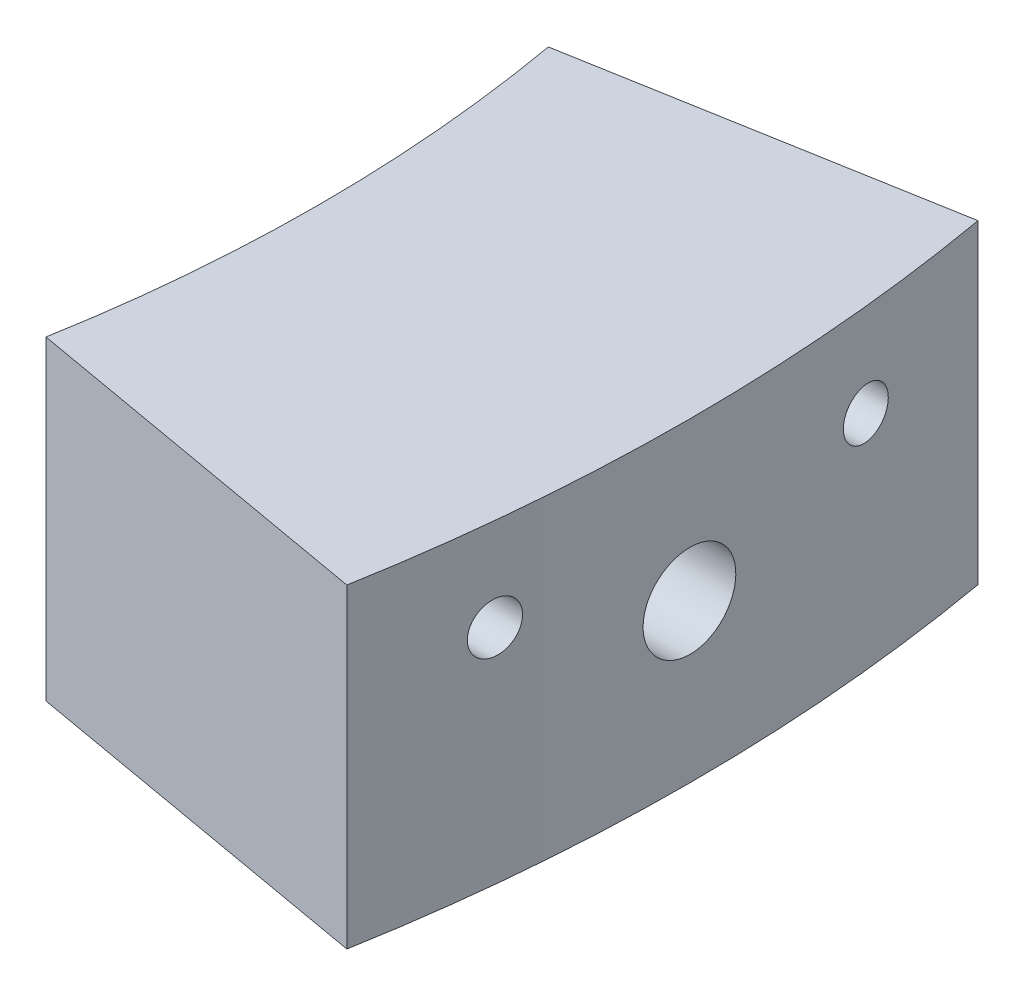
ISO-10303-21;
HEADER;
FILE_DESCRIPTION(('STEP AP214'),'2;1');
FILE_NAME('part.step','',(''),(''),'','','');
FILE_SCHEMA(('AUTOMOTIVE_DESIGN { 1 0 10303 214 1 1 1 1 }'));
ENDSEC;
DATA;
#1=APPLICATION_CONTEXT('core data for automotive mechanical design processes');
#2=APPLICATION_PROTOCOL_DEFINITION('international standard','automotive_design',2000,#1);
#3=PRODUCT_CONTEXT('',#1,'mechanical');
#4=PRODUCT('Part','Part','',(#3));
#5=PRODUCT_RELATED_PRODUCT_CATEGORY('part','',(#4));
#6=PRODUCT_DEFINITION_FORMATION('','',#4);
#7=PRODUCT_DEFINITION_CONTEXT('part definition',#1,'design');
#8=PRODUCT_DEFINITION('design','',#6,#7);
#9=PRODUCT_DEFINITION_SHAPE('','',#8);
#10=(LENGTH_UNIT() NAMED_UNIT(*) SI_UNIT(.MILLI.,.METRE.));
#11=(NAMED_UNIT(*) PLANE_ANGLE_UNIT() SI_UNIT($,.RADIAN.));
#12=(NAMED_UNIT(*) SI_UNIT($,.STERADIAN.) SOLID_ANGLE_UNIT());
#13=UNCERTAINTY_MEASURE_WITH_UNIT(LENGTH_MEASURE(1.E-05),#10,'distance_accuracy_value','');
#14=(GEOMETRIC_REPRESENTATION_CONTEXT(3) GLOBAL_UNCERTAINTY_ASSIGNED_CONTEXT((#13)) GLOBAL_UNIT_ASSIGNED_CONTEXT((#10,
#11,#12)) REPRESENTATION_CONTEXT('',''));
#15=CARTESIAN_POINT('',(0.,0.,0.));
#16=DIRECTION('',(0.,0.,1.));
#17=DIRECTION('',(1.,0.,0.));
#18=AXIS2_PLACEMENT_3D('',#15,#16,#17);
#19=CARTESIAN_POINT('',(0.,-55.,0.));
#20=DIRECTION('',(0.,-1.,0.));
#21=DIRECTION('',(0.,0.,-1.));
#22=AXIS2_PLACEMENT_3D('',#19,#20,#21);
#23=CYLINDRICAL_SURFACE('',#22,98.);
#24=CARTESIAN_POINT('',(97.617506114426,12.,-8.65));
#25=CARTESIAN_POINT('',(97.6175058938993,12.0756007993206,-8.65000338407852));
#26=CARTESIAN_POINT('',(97.6169421117702,12.1512564351228,-8.65637224766953));
#27=CARTESIAN_POINT('',(97.6146939909887,12.3004805079778,-8.6816860254161));
#28=CARTESIAN_POINT('',(97.6130083052985,12.3740463249972,-8.70064605737195));
#29=CARTESIAN_POINT('',(97.6085438644557,12.5169036890432,-8.75058795159761));
#30=CARTESIAN_POINT('',(97.6057657101686,12.5861975614752,-8.78156320528482));
#31=CARTESIAN_POINT('',(97.5991641563164,12.7185719489254,-8.85463127721825));
#32=CARTESIAN_POINT('',(97.5953410107909,12.7816539689944,-8.89672139333398));
#33=CARTESIAN_POINT('',(97.5867108456557,12.8999563939583,-8.99088976889658));
#34=CARTESIAN_POINT('',(97.5819021993175,12.9551635412288,-9.04298453357049));
#35=CARTESIAN_POINT('',(97.571398069416,13.0560532320898,-9.15562514482282));
#36=CARTESIAN_POINT('',(97.5657025366273,13.1017352466699,-9.21617146047505));
#37=CARTESIAN_POINT('',(97.5535211950221,13.1824622700676,-9.34423075414013));
#38=CARTESIAN_POINT('',(97.5470325050066,13.2174667806461,-9.41176898616757));
#39=CARTESIAN_POINT('',(97.533429720916,13.2756455349094,-9.55170268231237));
#40=CARTESIAN_POINT('',(97.5263156127135,13.2988195112761,-9.62409825614252));
#41=CARTESIAN_POINT('',(97.5116044276869,13.3327841113824,-9.77202884155926));
#42=CARTESIAN_POINT('',(97.5040053693319,13.3435199734052,-9.8475762305508));
#43=CARTESIAN_POINT('',(97.4885547871177,13.3521387874624,-9.99937526415877));
#44=CARTESIAN_POINT('',(97.4807032581113,13.3500214772838,-10.0756269231111));
#45=CARTESIAN_POINT('',(97.4649455743222,13.3329724903921,-10.2269345253978));
#46=CARTESIAN_POINT('',(97.4570393248677,13.317998928458,-10.3019857427445));
#47=CARTESIAN_POINT('',(97.4414392979856,13.275600442672,-10.4485089621508));
#48=CARTESIAN_POINT('',(97.4337455225573,13.2481754016927,-10.5199809305343));
#49=CARTESIAN_POINT('',(97.4188176592374,13.1816254382963,-10.6573329097117));
#50=CARTESIAN_POINT('',(97.4115837077598,13.1424970633614,-10.7232112629995));
#51=CARTESIAN_POINT('',(97.3978259035663,13.0536329011521,-10.8474615797574));
#52=CARTESIAN_POINT('',(97.3913020404219,13.00389726969,-10.9058336534687));
#53=CARTESIAN_POINT('',(97.3792204690145,12.8954056254773,-11.0131891665927));
#54=CARTESIAN_POINT('',(97.3736594560466,12.8366818246748,-11.0622047812184));
#55=CARTESIAN_POINT('',(97.3636834646136,12.7117434448966,-11.1496675443441));
#56=CARTESIAN_POINT('',(97.3592684481071,12.6455291146744,-11.188115043656));
#57=CARTESIAN_POINT('',(97.3517778847092,12.5079162999805,-11.2531067580318));
#58=CARTESIAN_POINT('',(97.3486944180242,12.4365514990423,-11.2797213814947));
#59=CARTESIAN_POINT('',(97.3439495736175,12.2903226894122,-11.3205966594754));
#60=CARTESIAN_POINT('',(97.3422881466805,12.2154588019146,-11.3348577415365));
#61=CARTESIAN_POINT('',(97.3404586449799,12.0647924635099,-11.350558314679));
#62=CARTESIAN_POINT('',(97.3402825161529,11.9889973094097,-11.3520669562692));
#63=CARTESIAN_POINT('',(97.3414094439378,11.8382323626186,-11.3423996725422));
#64=CARTESIAN_POINT('',(97.342712477651,11.7632625571687,-11.3312239435907));
#65=CARTESIAN_POINT('',(97.3467426215184,11.6164040982219,-11.2965482225053));
#66=CARTESIAN_POINT('',(97.3494673390388,11.5445104869015,-11.2730689364551));
#67=CARTESIAN_POINT('',(97.3562333189262,11.4056943117121,-11.2144860951274));
#68=CARTESIAN_POINT('',(97.360274596349,11.3387718047018,-11.1793824069169));
#69=CARTESIAN_POINT('',(97.3695343466853,11.2115692537785,-11.0984430925857));
#70=CARTESIAN_POINT('',(97.3747563768328,11.151310118731,-11.0525750206201));
#71=CARTESIAN_POINT('',(97.3861776394716,11.0393390634186,-10.9514832664502));
#72=CARTESIAN_POINT('',(97.3923769022613,10.9876274082642,-10.8962592941687));
#73=CARTESIAN_POINT('',(97.4055719951196,10.8938898621378,-10.7776675631688));
#74=CARTESIAN_POINT('',(97.41257235092,10.8519235123728,-10.7142532457144));
#75=CARTESIAN_POINT('',(97.4270998095378,10.7792272701204,-10.5813367298362));
#76=CARTESIAN_POINT('',(97.4346269287605,10.7484977277735,-10.511834341791));
#77=CARTESIAN_POINT('',(97.4500060785924,10.6989796327809,-10.3682953919038));
#78=CARTESIAN_POINT('',(97.4578596789248,10.6802582136608,-10.2942358324461));
#79=CARTESIAN_POINT('',(97.4736089499044,10.6555483344656,-10.1440257914772));
#80=CARTESIAN_POINT('',(97.4815046213789,10.6495601257032,-10.0678752687271));
#81=CARTESIAN_POINT('',(97.4971272847418,10.650491387794,-9.91544527744967));
#82=CARTESIAN_POINT('',(97.5048538142863,10.657442623514,-9.83916595208761));
#83=CARTESIAN_POINT('',(97.5199064361653,10.6841333049673,-9.68883674286622));
#84=CARTESIAN_POINT('',(97.5272325287914,10.7038727413894,-9.61478685738365));
#85=CARTESIAN_POINT('',(97.5412885728223,10.7555672859957,-9.47112614740109));
#86=CARTESIAN_POINT('',(97.548019261618,10.7875070160195,-9.4015098628223));
#87=CARTESIAN_POINT('',(97.5607355720813,10.862716795528,-9.26862102172229));
#88=CARTESIAN_POINT('',(97.5667212363069,10.9059861973873,-9.20534810288802));
#89=CARTESIAN_POINT('',(97.5777953632539,11.0024501668243,-9.08720888408853));
#90=CARTESIAN_POINT('',(97.5828872310794,11.0556054035995,-9.03231078804239));
#91=CARTESIAN_POINT('',(97.5921011766639,11.1704689378447,-8.93220701905186));
#92=CARTESIAN_POINT('',(97.5962230349727,11.2321791657457,-8.88700353957502));
#93=CARTESIAN_POINT('',(97.603404334642,11.3621211873785,-8.80778311484221));
#94=CARTESIAN_POINT('',(97.6064678486473,11.4303266633606,-8.7737233146981));
#95=CARTESIAN_POINT('',(97.6114988775306,11.5714705552505,-8.71757358768449));
#96=CARTESIAN_POINT('',(97.6134677350447,11.6444030500926,-8.6954689982246));
#97=CARTESIAN_POINT('',(97.6157502674053,11.7648405875568,-8.66979757609393));
#98=CARTESIAN_POINT('',(97.6164081827595,11.8115540427385,-8.66238296265514));
#99=CARTESIAN_POINT('',(97.617286174771,11.9055045233873,-8.65248312169049));
#100=CARTESIAN_POINT('',(97.6175062522784,11.9527415478378,-8.64999788459495));
#101=CARTESIAN_POINT('',(97.617506114426,12.,-8.65));
#102=B_SPLINE_CURVE_WITH_KNOTS('',3,(#24,#25,#26,#27,#28,#29,#30,#31,#32,#33,#34,#35,#36,#37,
#38,#39,#40,#41,#42,#43,#44,#45,#46,#47,#48,#49,#50,#51,#52,#53,#54,#55,#56,#57,#58,#59,#60,#61,
#62,#63,#64,#65,#66,#67,#68,#69,#70,#71,#72,#73,#74,#75,#76,#77,#78,#79,#80,#81,#82,#83,#84,#85,
#86,#87,#88,#89,#90,#91,#92,#93,#94,#95,#96,#97,#98,#99,#100,#101),.UNSPECIFIED.,.T.,.F.,(4,2,2,
2,2,2,2,2,2,2,2,2,2,2,2,2,2,2,2,2,2,2,2,2,2,2,2,2,2,2,2,2,2,2,2,2,2,2,4),(0.,0.226629599913219,
0.453531799664552,0.680309375784831,0.907031870758643,1.13413166648978,1.3612440716171,
1.58920746698041,1.81717601308778,2.0461444751452,2.27511760832359,2.50483957098709,
2.73456369462449,2.96435565450426,3.19414423915325,3.42312779477472,3.65210374830057,
3.87969838473457,4.10728514403756,4.33363700997512,4.55998537182448,4.78595402177813,
5.01192525592659,5.23858656144373,5.4652548958188,5.69327367119327,5.9212995510557,
6.15058938689487,6.37988374813849,6.60974174347262,6.83959957144371,7.06916862045153,
7.29872454972031,7.52738600430264,7.75609914051431,7.98392209091633,8.21146498823325,
8.35313260279017,8.49479994231946),.UNSPECIFIED.);
#103=CARTESIAN_POINT('',(97.617506114426,12.,-8.65));
#104=VERTEX_POINT('',#103);
#105=EDGE_CURVE('E120',#104,#104,#102,.T.);
#106=ORIENTED_EDGE('',*,*,#105,.T.);
#107=EDGE_LOOP('',(#106));
#108=FACE_BOUND('',#107,.T.);
#109=CARTESIAN_POINT('',(0.,0.,0.));
#110=DIRECTION('',(0.,-1.,0.));
#111=DIRECTION('',(0.,0.,-1.));
#112=AXIS2_PLACEMENT_3D('',#109,#110,#111);
#113=CIRCLE('',#112,98.);
#114=CARTESIAN_POINT('',(96.5111597951964,0.,-17.0175214113592));
#115=VERTEX_POINT('',#114);
#116=CARTESIAN_POINT('',(96.5111597951964,0.,17.0175214113592));
#117=VERTEX_POINT('',#116);
#118=EDGE_CURVE('E47',#115,#117,#113,.T.);
#119=ORIENTED_EDGE('',*,*,#118,.F.);
#120=DIRECTION('',(0.,1.,0.));
#121=VECTOR('',#120,1.);
#122=CARTESIAN_POINT('',(96.5111597951964,17.,-17.0175214113592));
#123=LINE('',#122,#121);
#124=CARTESIAN_POINT('',(96.5111597951964,17.,-17.0175214113592));
#125=VERTEX_POINT('',#124);
#126=EDGE_CURVE('E87',#115,#125,#123,.T.);
#127=ORIENTED_EDGE('',*,*,#126,.T.);
#128=CARTESIAN_POINT('',(0.,17.,0.));
#129=DIRECTION('',(0.,-1.,0.));
#130=DIRECTION('',(0.,0.,-1.));
#131=AXIS2_PLACEMENT_3D('',#128,#129,#130);
#132=CIRCLE('',#131,98.);
#133=CARTESIAN_POINT('',(96.5111597951964,17.,17.0175214113592));
#134=VERTEX_POINT('',#133);
#135=EDGE_CURVE('E11',#125,#134,#132,.T.);
#136=ORIENTED_EDGE('',*,*,#135,.T.);
#137=DIRECTION('',(0.,1.,0.));
#138=VECTOR('',#137,1.);
#139=CARTESIAN_POINT('',(96.5111597951964,17.,17.0175214113592));
#140=LINE('',#139,#138);
#141=EDGE_CURVE('E99',#117,#134,#140,.T.);
#142=ORIENTED_EDGE('',*,*,#141,.F.);
#143=EDGE_LOOP('',(#119,#127,#136,#142));
#144=FACE_BOUND('',#143,.T.);
#145=CARTESIAN_POINT('',(97.9681070553065,8.5,2.5));
#146=CARTESIAN_POINT('',(97.968107485919,8.64040158260716,2.49999378126655));
#147=CARTESIAN_POINT('',(97.9684121189138,8.78090438813225,2.48813274061241));
#148=CARTESIAN_POINT('',(97.969598041761,9.05803879705092,2.44098223178922));
#149=CARTESIAN_POINT('',(97.9704800218772,9.19466556207155,2.4056647188224));
#150=CARTESIAN_POINT('',(97.9727206630696,9.45999291119347,2.3126088372722));
#151=CARTESIAN_POINT('',(97.9740790924453,9.58869731229674,2.25488136535125));
#152=CARTESIAN_POINT('',(97.9771192675297,9.83455230261818,2.11865968320301));
#153=CARTESIAN_POINT('',(97.9788009338786,9.95170571712585,2.04017056851032));
#154=CARTESIAN_POINT('',(97.9822988269544,10.171212707976,1.86461886388693));
#155=CARTESIAN_POINT('',(97.984115094958,10.2735617157904,1.76755056193709));
#156=CARTESIAN_POINT('',(97.9876771078848,10.4605163734568,1.55760519734132));
#157=CARTESIAN_POINT('',(97.9894228500082,10.5451213194385,1.44472750786558));
#158=CARTESIAN_POINT('',(97.9926471673846,10.6941909251843,1.20635372303399));
#159=CARTESIAN_POINT('',(97.994125711171,10.7586532134957,1.08085614419978));
#160=CARTESIAN_POINT('',(97.9966486747316,10.8655920635036,0.820815651392319));
#161=CARTESIAN_POINT('',(97.9976930960059,10.908068701165,0.686272768674207));
#162=CARTESIAN_POINT('',(97.999229876335,10.9698216851936,0.41199194423426));
#163=CARTESIAN_POINT('',(97.999722356071,10.9891031032261,0.272255145060123));
#164=CARTESIAN_POINT('',(98.0001001407963,11.0039339288226,-0.0084726653707868));
#165=CARTESIAN_POINT('',(97.9999854478403,10.9994834166901,-0.14946367238199));
#166=CARTESIAN_POINT('',(97.9991619207296,10.9669810409501,-0.428663296402774));
#167=CARTESIAN_POINT('',(97.9984532247125,10.9389346646373,-0.566872552666637));
#168=CARTESIAN_POINT('',(97.9965217300213,10.8600451753218,-0.836620409790409));
#169=CARTESIAN_POINT('',(97.9952989303794,10.8092020194081,-0.968158998093375));
#170=CARTESIAN_POINT('',(97.9924768188702,10.6861559344986,-1.22084919433756));
#171=CARTESIAN_POINT('',(97.990877462657,10.6139504894839,-1.34199957660205));
#172=CARTESIAN_POINT('',(97.9874825014726,10.4502313740402,-1.57046085749863));
#173=CARTESIAN_POINT('',(97.9856868961991,10.3587176738643,-1.67777173480868));
#174=CARTESIAN_POINT('',(97.9821012141159,10.1589487168563,-1.87553984246272));
#175=CARTESIAN_POINT('',(97.9803111390278,10.050688695938,-1.96599226062271));
#176=CARTESIAN_POINT('',(97.9769388477739,9.82051703856403,-2.12743877338321));
#177=CARTESIAN_POINT('',(97.97535663164,9.69860540001149,-2.19843286499489));
#178=CARTESIAN_POINT('',(97.9725784941908,9.44458849614742,-2.31894689803893));
#179=CARTESIAN_POINT('',(97.9713825756067,9.31248315877174,-2.36846668764277));
#180=CARTESIAN_POINT('',(97.9695119931908,9.04183009614148,-2.44462333931151));
#181=CARTESIAN_POINT('',(97.9688373283254,8.90328238366224,-2.47126024675155));
#182=CARTESIAN_POINT('',(97.9680855085796,8.62371932373841,-2.50088910759738));
#183=CARTESIAN_POINT('',(97.968008185302,8.48270468298385,-2.50388772489719));
#184=CARTESIAN_POINT('',(97.9684593277916,8.20217394484546,-2.48617224676661));
#185=CARTESIAN_POINT('',(97.9689877930589,8.06265784622525,-2.46545817090224));
#186=CARTESIAN_POINT('',(97.9705907835769,7.78910315987337,-2.40091082591723));
#187=CARTESIAN_POINT('',(97.971665237386,7.65506385799192,-2.3570805814742));
#188=CARTESIAN_POINT('',(97.9742390172399,7.39624577728101,-2.24754816169502));
#189=CARTESIAN_POINT('',(97.975738343888,7.27146701160168,-2.18184595530099));
#190=CARTESIAN_POINT('',(97.978993256679,7.03468134795426,-2.03041749090833));
#191=CARTESIAN_POINT('',(97.9807489002402,6.92267732173128,-1.9446867436709));
#192=CARTESIAN_POINT('',(97.9843183228818,6.7146493747087,-1.75564138414763));
#193=CARTESIAN_POINT('',(97.986132102076,6.61862548518069,-1.65232673745259));
#194=CARTESIAN_POINT('',(97.9896138117065,6.44526139722469,-1.43101779835808));
#195=CARTESIAN_POINT('',(97.9912817085364,6.36792549668027,-1.31302013857839));
#196=CARTESIAN_POINT('',(97.9942831516635,6.23416209345677,-1.06571196806448));
#197=CARTESIAN_POINT('',(97.9956166986034,6.1777345505873,-0.936401479076576));
#198=CARTESIAN_POINT('',(97.9977989503728,6.0873971567584,-0.670154542831078));
#199=CARTESIAN_POINT('',(97.9986477152983,6.05348451465369,-0.533219043119038));
#200=CARTESIAN_POINT('',(97.999764960206,6.00913041665887,-0.255595690200751));
#201=CARTESIAN_POINT('',(98.0000334402659,5.99868895762704,-0.114907837496774));
#202=CARTESIAN_POINT('',(97.9999598526234,6.00157396799025,0.16618345178214));
#203=CARTESIAN_POINT('',(97.9996179591967,6.01489365303175,0.306586958085752));
#204=CARTESIAN_POINT('',(97.9983624962978,6.06490892902668,0.583164337772367));
#205=CARTESIAN_POINT('',(97.9974489256882,6.10160456649251,0.719338202738857));
#206=CARTESIAN_POINT('',(97.9951530311703,6.19732940343915,0.98359402754766));
#207=CARTESIAN_POINT('',(97.9937706990715,6.25635899316206,1.11167584595166));
#208=CARTESIAN_POINT('',(97.9906930812302,6.39507305368881,1.3561079283874));
#209=CARTESIAN_POINT('',(97.9889978070745,6.47475675981197,1.47245862652083));
#210=CARTESIAN_POINT('',(97.9854849037729,6.65253439797914,1.69015520138881));
#211=CARTESIAN_POINT('',(97.9836672527697,6.7506316243948,1.79149838730911));
#212=CARTESIAN_POINT('',(97.9801142485092,6.96247618604376,1.97630465077829));
#213=CARTESIAN_POINT('',(97.9783789157628,7.07622739447693,2.05976329011864));
#214=CARTESIAN_POINT('',(97.9751857225554,7.31618857858428,2.2064417635846));
#215=CARTESIAN_POINT('',(97.9737280294355,7.44240599883694,2.26964940743262));
#216=CARTESIAN_POINT('',(97.971257657333,7.70356709527613,2.37390357618586));
#217=CARTESIAN_POINT('',(97.9702444471708,7.83850013329794,2.41497656661719));
#218=CARTESIAN_POINT('',(97.9690485345763,8.06190636349387,2.46289357520565));
#219=CARTESIAN_POINT('',(97.9686970101231,8.14892902850971,2.47679101533046));
#220=CARTESIAN_POINT('',(97.9682261354992,8.32395452799873,2.49534617656206));
#221=CARTESIAN_POINT('',(97.9681067852793,8.41195736226427,2.50000389962625));
#222=CARTESIAN_POINT('',(97.9681070553065,8.5,2.5));
#223=B_SPLINE_CURVE_WITH_KNOTS('',3,(#145,#146,#147,#148,#149,#150,#151,#152,#153,#154,#155,
#156,#157,#158,#159,#160,#161,#162,#163,#164,#165,#166,#167,#168,#169,#170,#171,#172,#173,#174,
#175,#176,#177,#178,#179,#180,#181,#182,#183,#184,#185,#186,#187,#188,#189,#190,#191,#192,#193,
#194,#195,#196,#197,#198,#199,#200,#201,#202,#203,#204,#205,#206,#207,#208,#209,#210,#211,#212,
#213,#214,#215,#216,#217,#218,#219,#220,#221,#222),.UNSPECIFIED.,.T.,.F.,(4,2,2,2,2,2,2,2,2,2,2,
2,2,2,2,2,2,2,2,2,2,2,2,2,2,2,2,2,2,2,2,2,2,2,2,2,2,2,4),(0.,0.420883383923988,
0.842270888378501,1.26345375267084,1.68453334171725,2.10574259678617,2.52696855720151,
2.94824409108494,3.36951816936732,3.79070011876548,4.2118806429795,4.63296324736447,
5.0540466443708,5.47517965571612,5.89631331587841,6.31756700357265,6.73882075597217,
7.16007748668935,7.5813333820822,8.00247051655574,8.4236073035374,8.84468899976766,
9.2657712939305,9.68694806106084,10.1081256523838,10.5294000145863,10.950673567004,
11.3718948848873,11.7931161463884,12.214217158773,12.635319009048,13.0564282175937,
13.4775218375717,13.898690867541,14.3199642936075,14.7414908347943,15.16251224888,
15.426438698011,15.6903650912304),.UNSPECIFIED.);
#224=CARTESIAN_POINT('',(97.9681070553065,8.5,2.5));
#225=VERTEX_POINT('',#224);
#226=EDGE_CURVE('E100',#225,#225,#223,.T.);
#227=ORIENTED_EDGE('',*,*,#226,.T.);
#228=EDGE_LOOP('',(#227));
#229=FACE_BOUND('',#228,.T.);
#230=CARTESIAN_POINT('',(97.3405234216459,12.,11.35));
#231=CARTESIAN_POINT('',(97.3405238985553,12.0754638648849,11.3499965911601));
#232=CARTESIAN_POINT('',(97.3412644310656,12.1509825849718,11.3436504908883));
#233=CARTESIAN_POINT('',(97.3442000569033,12.2999326510784,11.318430550952));
#234=CARTESIAN_POINT('',(97.3463969011006,12.3733613734081,11.2995416314729));
#235=CARTESIAN_POINT('',(97.3521579447706,12.5159444430285,11.2497985126167));
#236=CARTESIAN_POINT('',(97.3557212804354,12.5851014586168,11.2189518720088));
#237=CARTESIAN_POINT('',(97.3640772443317,12.7172241326816,11.1462009885888));
#238=CARTESIAN_POINT('',(97.3688695865325,12.7801912270489,11.104299318586));
#239=CARTESIAN_POINT('',(97.3795225064962,12.8984029990248,11.0104870733307));
#240=CARTESIAN_POINT('',(97.3853865456494,12.9536215979908,10.9585440338961));
#241=CARTESIAN_POINT('',(97.3979604175589,13.0545680971438,10.8462202577641));
#242=CARTESIAN_POINT('',(97.404670308935,13.1002953389741,10.7858389362411));
#243=CARTESIAN_POINT('',(97.4187471109318,13.1812562593298,10.6579486238244));
#244=CARTESIAN_POINT('',(97.4261178259064,13.2164233365429,10.5903978873537));
#245=CARTESIAN_POINT('',(97.4412352132167,13.2749141203946,10.4503891589164));
#246=CARTESIAN_POINT('',(97.4489818960009,13.298237497679,10.3779310305466));
#247=CARTESIAN_POINT('',(97.4646449739879,13.3324807297961,10.2297874380116));
#248=CARTESIAN_POINT('',(97.4725620045163,13.3433406176094,10.1540881735803));
#249=CARTESIAN_POINT('',(97.4882927608992,13.3521478382795,10.0019310052802));
#250=CARTESIAN_POINT('',(97.4961064857563,13.3500950465778,9.92547309410032));
#251=CARTESIAN_POINT('',(97.5114214030391,13.3331128555162,9.77386868965295));
#252=CARTESIAN_POINT('',(97.5189221876199,13.3181671710183,9.69872397762216));
#253=CARTESIAN_POINT('',(97.5334040293795,13.2757820096316,9.5519912646198));
#254=CARTESIAN_POINT('',(97.5403850903122,13.2483426229958,9.48040323795927));
#255=CARTESIAN_POINT('',(97.5536425230083,13.1818039976323,9.34299681653559));
#256=CARTESIAN_POINT('',(97.5599204438193,13.1427311121581,9.27716581191186));
#257=CARTESIAN_POINT('',(97.5716485478158,13.0539939769671,9.15299378765771));
#258=CARTESIAN_POINT('',(97.5770987486043,13.0043299525455,9.09465260874561));
#259=CARTESIAN_POINT('',(97.5870373370423,12.8960410521386,8.98738228594786));
#260=CARTESIAN_POINT('',(97.5915296486052,12.8374544876003,8.93841483116842));
#261=CARTESIAN_POINT('',(97.5994952814251,12.7128281253679,8.85101424258972));
#262=CARTESIAN_POINT('',(97.6029686261404,12.6467884993041,8.8125808662797));
#263=CARTESIAN_POINT('',(97.608822099932,12.5094292082689,8.74750915322322));
#264=CARTESIAN_POINT('',(97.6112067506231,12.4381328371313,8.72082204822512));
#265=CARTESIAN_POINT('',(97.614864348484,12.2920465205618,8.67978607950772));
#266=CARTESIAN_POINT('',(97.6161373153129,12.2172566369344,8.66543699760068));
#267=CARTESIAN_POINT('',(97.6175491083862,12.0665325472068,8.64951854395059));
#268=CARTESIAN_POINT('',(97.6176911236164,11.9906021640122,8.6479132381533));
#269=CARTESIAN_POINT('',(97.616847180644,11.8395506531571,8.6574342917708));
#270=CARTESIAN_POINT('',(97.6158612313783,11.7644295190898,8.66856055031351));
#271=CARTESIAN_POINT('',(97.6127782519995,11.6171880228797,8.70320750807748));
#272=CARTESIAN_POINT('',(97.6106820821019,11.5450653840546,8.72671861126001));
#273=CARTESIAN_POINT('',(97.6054135979262,11.4057986995408,8.78544822936005));
#274=CARTESIAN_POINT('',(97.6022412801686,11.3386546699494,8.82066678212898));
#275=CARTESIAN_POINT('',(97.5948700862851,11.2111437109513,8.90185319042564));
#276=CARTESIAN_POINT('',(97.590669761198,11.1507865242885,8.94783621429939));
#277=CARTESIAN_POINT('',(97.5813226321452,11.0386488769401,9.04920202029316));
#278=CARTESIAN_POINT('',(97.5761758139972,10.9868685447927,9.1045849432609));
#279=CARTESIAN_POINT('',(97.5650197248982,10.8931659734527,9.22336648738432));
#280=CARTESIAN_POINT('',(97.5590076513764,10.8512769840891,9.28679107288269));
#281=CARTESIAN_POINT('',(97.5462641244818,10.7787350947477,9.4197031275333));
#282=CARTESIAN_POINT('',(97.5395326553952,10.7480824402707,9.48919072911437));
#283=CARTESIAN_POINT('',(97.5254771119805,10.6987417910935,9.63257604363354));
#284=CARTESIAN_POINT('',(97.5181505876657,10.6801064119248,9.70649162232801));
#285=CARTESIAN_POINT('',(97.5031165262437,10.6555163659937,9.85636535934353));
#286=CARTESIAN_POINT('',(97.4954089792296,10.6495620291234,9.93232357075077));
#287=CARTESIAN_POINT('',(97.4797929006922,10.6504899695436,10.0844357065722));
#288=CARTESIAN_POINT('',(97.4718837123873,10.6574215049629,10.1605892661475));
#289=CARTESIAN_POINT('',(97.4561248235508,10.684019302326,10.3106463637201));
#290=CARTESIAN_POINT('',(97.4482751239547,10.7036857641288,10.3845498663866));
#291=CARTESIAN_POINT('',(97.4328692613726,10.7552431308162,10.5281152695401));
#292=CARTESIAN_POINT('',(97.4253135283555,10.7871512514263,10.5977710357264));
#293=CARTESIAN_POINT('',(97.4107581159809,10.8623018577461,10.7307353865598));
#294=CARTESIAN_POINT('',(97.4037584112153,10.9055438251598,10.7940442612666));
#295=CARTESIAN_POINT('',(97.3905754597257,11.002035715155,10.9123486164912));
#296=CARTESIAN_POINT('',(97.3843902597688,11.0552609249728,10.9673640329001));
#297=CARTESIAN_POINT('',(97.3730404320074,11.17031142294,11.0676805629712));
#298=CARTESIAN_POINT('',(97.3678760304698,11.2321386126131,11.1129795231045));
#299=CARTESIAN_POINT('',(97.3587889096424,11.3622874095192,11.1923104612624));
#300=CARTESIAN_POINT('',(97.3548600725867,11.4305747689894,11.2263979912579));
#301=CARTESIAN_POINT('',(97.3483652497533,11.571911297857,11.2825790870108));
#302=CARTESIAN_POINT('',(97.3457975623512,11.6449543929842,11.3046876289202));
#303=CARTESIAN_POINT('',(97.3428192516716,11.7653996280743,11.3302969933968));
#304=CARTESIAN_POINT('',(97.3419597447279,11.8120017707833,11.3376760419847));
#305=CARTESIAN_POINT('',(97.3408116818367,11.9057288066999,11.3475286007031));
#306=CARTESIAN_POINT('',(97.3405231236952,11.9528536978981,11.3500021296841));
#307=CARTESIAN_POINT('',(97.3405234216459,12.,11.35));
#308=B_SPLINE_CURVE_WITH_KNOTS('',3,(#230,#231,#232,#233,#234,#235,#236,#237,#238,#239,#240,
#241,#242,#243,#244,#245,#246,#247,#248,#249,#250,#251,#252,#253,#254,#255,#256,#257,#258,#259,
#260,#261,#262,#263,#264,#265,#266,#267,#268,#269,#270,#271,#272,#273,#274,#275,#276,#277,#278,
#279,#280,#281,#282,#283,#284,#285,#286,#287,#288,#289,#290,#291,#292,#293,#294,#295,#296,#297,
#298,#299,#300,#301,#302,#303,#304,#305,#306,#307),.UNSPECIFIED.,.T.,.F.,(4,2,2,2,2,2,2,2,2,2,2,
2,2,2,2,2,2,2,2,2,2,2,2,2,2,2,2,2,2,2,2,2,2,2,2,2,2,2,4),(0.,0.226218869604055,
0.452710208256998,0.679058609022171,0.905354378686959,1.13239439247609,1.35945014936576,
1.58790920646868,1.81637461629918,2.04593471944925,2.2754970369892,2.50534974219532,
2.7352007869964,2.96453506342682,3.19386446193325,3.42223557325884,3.65060142668688,
3.87800999374036,4.10541453917843,4.33217763580319,4.55893893579805,4.78552479423497,
5.01211138525515,5.23901920477311,5.46593042456941,5.69359388231198,5.92126231394144,
6.14992090290368,6.37858544025233,6.6081258790974,6.8376699203839,7.0675379650859,
7.29739549977357,7.52669137441048,7.75603801716791,7.98423051266909,8.21213705935613,
8.35346859820633,8.49479959395861),.UNSPECIFIED.);
#309=CARTESIAN_POINT('',(97.3405234216459,12.,11.35));
#310=VERTEX_POINT('',#309);
#311=EDGE_CURVE('E39',#310,#310,#308,.T.);
#312=ORIENTED_EDGE('',*,*,#311,.T.);
#313=EDGE_LOOP('',(#312));
#314=FACE_BOUND('',#313,.T.);
#315=ADVANCED_FACE('F35',(#108,#144,#229,#314),#23,.T.);
#316=CARTESIAN_POINT('',(76.8150047349522,17.,-13.5445578580206));
#317=DIRECTION('',(0.,1.,0.));
#318=DIRECTION('',(0.,0.,1.));
#319=AXIS2_PLACEMENT_3D('',#316,#317,#318);
#320=PLANE('',#319);
#321=ORIENTED_EDGE('',*,*,#135,.F.);
#322=DIRECTION('',(-0.984807753012208,0.,0.173648177666931));
#323=VECTOR('',#322,1.);
#324=CARTESIAN_POINT('',(76.8150047349522,17.,-13.5445578580206));
#325=LINE('',#324,#323);
#326=CARTESIAN_POINT('',(76.8150047349522,17.,-13.5445578580206));
#327=VERTEX_POINT('',#326);
#328=EDGE_CURVE('E82',#125,#327,#325,.T.);
#329=ORIENTED_EDGE('',*,*,#328,.T.);
#330=CARTESIAN_POINT('',(0.,17.,0.));
#331=DIRECTION('',(0.,-1.,0.));
#332=DIRECTION('',(0.,0.,-1.));
#333=AXIS2_PLACEMENT_3D('',#330,#331,#332);
#334=CIRCLE('',#333,78.);
#335=CARTESIAN_POINT('',(76.8150047349522,17.,13.5445578580206));
#336=VERTEX_POINT('',#335);
#337=EDGE_CURVE('E76',#327,#336,#334,.T.);
#338=ORIENTED_EDGE('',*,*,#337,.T.);
#339=DIRECTION('',(-0.984807753012208,0.,-0.173648177666931));
#340=VECTOR('',#339,1.);
#341=CARTESIAN_POINT('',(76.8150047349522,17.,13.5445578580206));
#342=LINE('',#341,#340);
#343=EDGE_CURVE('E80',#134,#336,#342,.T.);
#344=ORIENTED_EDGE('',*,*,#343,.F.);
#345=EDGE_LOOP('',(#321,#329,#338,#344));
#346=FACE_BOUND('',#345,.T.);
#347=ADVANCED_FACE('F78',(#346),#320,.T.);
#348=CARTESIAN_POINT('',(76.8150047349522,0.,-13.5445578580206));
#349=DIRECTION('',(0.,-1.,0.));
#350=DIRECTION('',(0.,0.,-1.));
#351=AXIS2_PLACEMENT_3D('',#348,#349,#350);
#352=PLANE('',#351);
#353=CARTESIAN_POINT('',(0.,0.,0.));
#354=DIRECTION('',(0.,-1.,0.));
#355=DIRECTION('',(0.,0.,-1.));
#356=AXIS2_PLACEMENT_3D('',#353,#354,#355);
#357=CIRCLE('',#356,78.);
#358=CARTESIAN_POINT('',(76.8150047349522,0.,-13.5445578580206));
#359=VERTEX_POINT('',#358);
#360=CARTESIAN_POINT('',(76.8150047349522,0.,13.5445578580206));
#361=VERTEX_POINT('',#360);
#362=EDGE_CURVE('E86',#359,#361,#357,.T.);
#363=ORIENTED_EDGE('',*,*,#362,.F.);
#364=DIRECTION('',(0.984807753012208,0.,-0.173648177666931));
#365=VECTOR('',#364,1.);
#366=CARTESIAN_POINT('',(76.8150047349522,0.,-13.5445578580206));
#367=LINE('',#366,#365);
#368=EDGE_CURVE('E113',#359,#115,#367,.T.);
#369=ORIENTED_EDGE('',*,*,#368,.T.);
#370=ORIENTED_EDGE('',*,*,#118,.T.);
#371=DIRECTION('',(0.984807753012208,0.,0.173648177666931));
#372=VECTOR('',#371,1.);
#373=CARTESIAN_POINT('',(76.8150047349522,0.,13.5445578580206));
#374=LINE('',#373,#372);
#375=EDGE_CURVE('E95',#361,#117,#374,.T.);
#376=ORIENTED_EDGE('',*,*,#375,.F.);
#377=EDGE_LOOP('',(#363,#369,#370,#376));
#378=FACE_BOUND('',#377,.T.);
#379=ADVANCED_FACE('F139',(#378),#352,.T.);
#380=CARTESIAN_POINT('',(0.,-55.,0.));
#381=DIRECTION('',(0.,-1.,0.));
#382=DIRECTION('',(0.,0.,-1.));
#383=AXIS2_PLACEMENT_3D('',#380,#381,#382);
#384=CYLINDRICAL_SURFACE('',#383,78.);
#385=DIRECTION('',(0.,-1.,0.));
#386=VECTOR('',#385,1.);
#387=CARTESIAN_POINT('',(76.8150047349522,17.,-13.5445578580206));
#388=LINE('',#387,#386);
#389=EDGE_CURVE('E111',#327,#359,#388,.T.);
#390=ORIENTED_EDGE('',*,*,#389,.T.);
#391=ORIENTED_EDGE('',*,*,#362,.T.);
#392=DIRECTION('',(0.,-1.,0.));
#393=VECTOR('',#392,1.);
#394=CARTESIAN_POINT('',(76.8150047349522,17.,13.5445578580206));
#395=LINE('',#394,#393);
#396=EDGE_CURVE('E90',#336,#361,#395,.T.);
#397=ORIENTED_EDGE('',*,*,#396,.F.);
#398=ORIENTED_EDGE('',*,*,#337,.F.);
#399=EDGE_LOOP('',(#390,#391,#397,#398));
#400=FACE_BOUND('',#399,.T.);
#401=ADVANCED_FACE('F91',(#400),#384,.F.);
#402=CARTESIAN_POINT('',(0.,0.,0.));
#403=DIRECTION('',(-0.173648177666931,0.,-0.984807753012208));
#404=DIRECTION('',(-0.984807753012208,0.,0.173648177666931));
#405=AXIS2_PLACEMENT_3D('',#402,#403,#404);
#406=PLANE('',#405);
#407=ORIENTED_EDGE('',*,*,#328,.F.);
#408=ORIENTED_EDGE('',*,*,#126,.F.);
#409=ORIENTED_EDGE('',*,*,#368,.F.);
#410=ORIENTED_EDGE('',*,*,#389,.F.);
#411=EDGE_LOOP('',(#407,#408,#409,#410));
#412=FACE_BOUND('',#411,.T.);
#413=ADVANCED_FACE('F133',(#412),#406,.T.);
#414=CARTESIAN_POINT('',(0.,0.,0.));
#415=DIRECTION('',(0.173648177666931,0.,-0.984807753012208));
#416=DIRECTION('',(-0.984807753012208,0.,-0.173648177666931));
#417=AXIS2_PLACEMENT_3D('',#414,#415,#416);
#418=PLANE('',#417);
#419=ORIENTED_EDGE('',*,*,#343,.T.);
#420=ORIENTED_EDGE('',*,*,#396,.T.);
#421=ORIENTED_EDGE('',*,*,#375,.T.);
#422=ORIENTED_EDGE('',*,*,#141,.T.);
#423=EDGE_LOOP('',(#419,#420,#421,#422));
#424=FACE_BOUND('',#423,.T.);
#425=ADVANCED_FACE('F98',(#424),#418,.F.);
#426=CARTESIAN_POINT('',(100.,8.5,0.));
#427=DIRECTION('',(-1.,0.,0.));
#428=DIRECTION('',(0.,0.,1.));
#429=AXIS2_PLACEMENT_3D('',#426,#427,#428);
#430=CYLINDRICAL_SURFACE('',#429,2.5);
#431=ORIENTED_EDGE('',*,*,#226,.F.);
#432=EDGE_LOOP('',(#431));
#433=FACE_BOUND('',#432,.T.);
#434=CARTESIAN_POINT('',(80.,8.5,0.));
#435=DIRECTION('',(1.,0.,0.));
#436=DIRECTION('',(0.,0.,-1.));
#437=AXIS2_PLACEMENT_3D('',#434,#435,#436);
#438=CIRCLE('',#437,2.5);
#439=CARTESIAN_POINT('',(80.,8.5,-2.5));
#440=VERTEX_POINT('',#439);
#441=EDGE_CURVE('E103',#440,#440,#438,.T.);
#442=ORIENTED_EDGE('',*,*,#441,.F.);
#443=EDGE_LOOP('',(#442));
#444=FACE_BOUND('',#443,.T.);
#445=ADVANCED_FACE('F124',(#433,#444),#430,.F.);
#446=CARTESIAN_POINT('',(80.,8.5,0.));
#447=DIRECTION('',(1.,0.,0.));
#448=DIRECTION('',(0.,0.,-1.));
#449=AXIS2_PLACEMENT_3D('',#446,#447,#448);
#450=PLANE('',#449);
#451=ORIENTED_EDGE('',*,*,#441,.T.);
#452=EDGE_LOOP('',(#451));
#453=FACE_BOUND('',#452,.T.);
#454=ADVANCED_FACE('F129',(#453),#450,.T.);
#455=CARTESIAN_POINT('',(100.,12.,-10.));
#456=DIRECTION('',(-1.,0.,0.));
#457=DIRECTION('',(0.,0.,1.));
#458=AXIS2_PLACEMENT_3D('',#455,#456,#457);
#459=CYLINDRICAL_SURFACE('',#458,1.35);
#460=ORIENTED_EDGE('',*,*,#105,.F.);
#461=EDGE_LOOP('',(#460));
#462=FACE_BOUND('',#461,.T.);
#463=CARTESIAN_POINT('',(80.,12.,-10.));
#464=DIRECTION('',(1.,0.,0.));
#465=DIRECTION('',(0.,0.,-1.));
#466=AXIS2_PLACEMENT_3D('',#463,#464,#465);
#467=CIRCLE('',#466,1.35);
#468=CARTESIAN_POINT('',(80.,12.,-11.35));
#469=VERTEX_POINT('',#468);
#470=EDGE_CURVE('E160',#469,#469,#467,.T.);
#471=ORIENTED_EDGE('',*,*,#470,.F.);
#472=EDGE_LOOP('',(#471));
#473=FACE_BOUND('',#472,.T.);
#474=ADVANCED_FACE('F169',(#462,#473),#459,.F.);
#475=CARTESIAN_POINT('',(80.,12.,-10.));
#476=DIRECTION('',(1.,0.,0.));
#477=DIRECTION('',(0.,0.,-1.));
#478=AXIS2_PLACEMENT_3D('',#475,#476,#477);
#479=PLANE('',#478);
#480=ORIENTED_EDGE('',*,*,#470,.T.);
#481=EDGE_LOOP('',(#480));
#482=FACE_BOUND('',#481,.T.);
#483=ADVANCED_FACE('F167',(#482),#479,.T.);
#484=CARTESIAN_POINT('',(100.,12.,10.));
#485=DIRECTION('',(-1.,0.,0.));
#486=DIRECTION('',(0.,0.,1.));
#487=AXIS2_PLACEMENT_3D('',#484,#485,#486);
#488=CYLINDRICAL_SURFACE('',#487,1.35);
#489=ORIENTED_EDGE('',*,*,#311,.F.);
#490=EDGE_LOOP('',(#489));
#491=FACE_BOUND('',#490,.T.);
#492=CARTESIAN_POINT('',(80.,12.,10.));
#493=DIRECTION('',(1.,0.,0.));
#494=DIRECTION('',(0.,0.,-1.));
#495=AXIS2_PLACEMENT_3D('',#492,#493,#494);
#496=CIRCLE('',#495,1.35);
#497=CARTESIAN_POINT('',(80.,12.,8.65));
#498=VERTEX_POINT('',#497);
#499=EDGE_CURVE('E158',#498,#498,#496,.T.);
#500=ORIENTED_EDGE('',*,*,#499,.F.);
#501=EDGE_LOOP('',(#500));
#502=FACE_BOUND('',#501,.T.);
#503=ADVANCED_FACE('F176',(#491,#502),#488,.F.);
#504=CARTESIAN_POINT('',(80.,12.,10.));
#505=DIRECTION('',(1.,0.,0.));
#506=DIRECTION('',(0.,0.,-1.));
#507=AXIS2_PLACEMENT_3D('',#504,#505,#506);
#508=PLANE('',#507);
#509=ORIENTED_EDGE('',*,*,#499,.T.);
#510=EDGE_LOOP('',(#509));
#511=FACE_BOUND('',#510,.T.);
#512=ADVANCED_FACE('F183',(#511),#508,.T.);
#513=CLOSED_SHELL('',(#315,#347,#379,#401,#413,#425,#445,#454,#474,#483,#503,#512));
#514=MANIFOLD_SOLID_BREP('B2',#513);
#515=ADVANCED_BREP_SHAPE_REPRESENTATION('',(#18,#514),#14);
#516=SHAPE_DEFINITION_REPRESENTATION(#9,#515);
ENDSEC;
END-ISO-10303-21;
